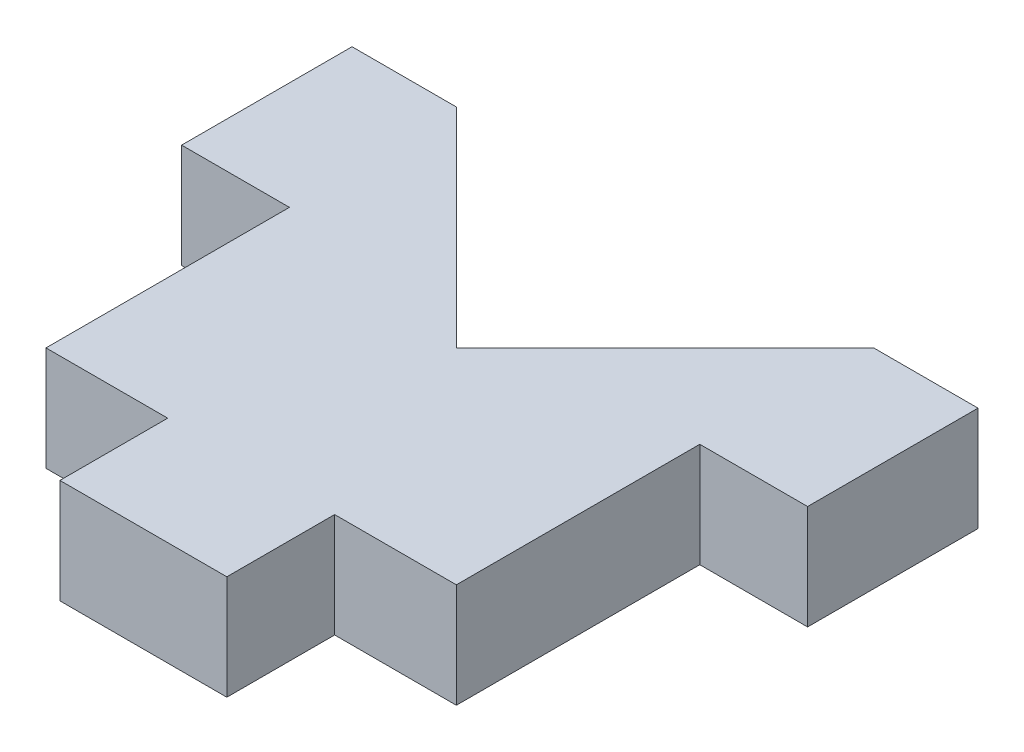
ISO-10303-21;
HEADER;
FILE_DESCRIPTION(('STEP AP214'),'2;1');
FILE_NAME('part.step','',(''),(''),'','','');
FILE_SCHEMA(('AUTOMOTIVE_DESIGN { 1 0 10303 214 1 1 1 1 }'));
ENDSEC;
DATA;
#1=APPLICATION_CONTEXT('core data for automotive mechanical design processes');
#2=APPLICATION_PROTOCOL_DEFINITION('international standard','automotive_design',2000,#1);
#3=PRODUCT_CONTEXT('',#1,'mechanical');
#4=PRODUCT('Part','Part','',(#3));
#5=PRODUCT_RELATED_PRODUCT_CATEGORY('part','',(#4));
#6=PRODUCT_DEFINITION_FORMATION('','',#4);
#7=PRODUCT_DEFINITION_CONTEXT('part definition',#1,'design');
#8=PRODUCT_DEFINITION('design','',#6,#7);
#9=PRODUCT_DEFINITION_SHAPE('','',#8);
#10=(LENGTH_UNIT() NAMED_UNIT(*) SI_UNIT(.MILLI.,.METRE.));
#11=(NAMED_UNIT(*) PLANE_ANGLE_UNIT() SI_UNIT($,.RADIAN.));
#12=(NAMED_UNIT(*) SI_UNIT($,.STERADIAN.) SOLID_ANGLE_UNIT());
#13=UNCERTAINTY_MEASURE_WITH_UNIT(LENGTH_MEASURE(1.E-05),#10,'distance_accuracy_value','');
#14=(GEOMETRIC_REPRESENTATION_CONTEXT(3) GLOBAL_UNCERTAINTY_ASSIGNED_CONTEXT((#13)) GLOBAL_UNIT_ASSIGNED_CONTEXT((#10,
#11,#12)) REPRESENTATION_CONTEXT('',''));
#15=CARTESIAN_POINT('',(0.,0.,0.));
#16=DIRECTION('',(0.,0.,1.));
#17=DIRECTION('',(1.,0.,0.));
#18=AXIS2_PLACEMENT_3D('',#15,#16,#17);
#19=CARTESIAN_POINT('',(8.99999999999995,2.99999999999998,0.));
#20=DIRECTION('',(0.,0.,-1.));
#21=DIRECTION('',(-1.,0.,0.));
#22=AXIS2_PLACEMENT_3D('',#19,#20,#21);
#23=PLANE('',#22);
#24=DIRECTION('',(0.,-1.,0.));
#25=VECTOR('',#24,1.);
#26=CARTESIAN_POINT('',(2.4,2.99999999999998,0.));
#27=LINE('',#26,#25);
#28=CARTESIAN_POINT('',(2.4,2.99999999999998,0.));
#29=VERTEX_POINT('',#28);
#30=CARTESIAN_POINT('',(2.4,0.,0.));
#31=VERTEX_POINT('',#30);
#32=EDGE_CURVE('E155',#29,#31,#27,.T.);
#33=ORIENTED_EDGE('',*,*,#32,.F.);
#34=DIRECTION('',(1.,0.,0.));
#35=VECTOR('',#34,1.);
#36=CARTESIAN_POINT('',(8.99999999999995,2.99999999999998,0.));
#37=LINE('',#36,#35);
#38=CARTESIAN_POINT('',(-2.4,2.99999999999998,0.));
#39=VERTEX_POINT('',#38);
#40=EDGE_CURVE('E213',#39,#29,#37,.T.);
#41=ORIENTED_EDGE('',*,*,#40,.F.);
#42=DIRECTION('',(0.,1.,0.));
#43=VECTOR('',#42,1.);
#44=CARTESIAN_POINT('',(-2.4,2.99999999999998,0.));
#45=LINE('',#44,#43);
#46=CARTESIAN_POINT('',(-2.4,0.,0.));
#47=VERTEX_POINT('',#46);
#48=EDGE_CURVE('E199',#47,#39,#45,.T.);
#49=ORIENTED_EDGE('',*,*,#48,.F.);
#50=DIRECTION('',(1.,0.,0.));
#51=VECTOR('',#50,1.);
#52=CARTESIAN_POINT('',(8.99999999999995,0.,0.));
#53=LINE('',#52,#51);
#54=EDGE_CURVE('E230',#47,#31,#53,.T.);
#55=ORIENTED_EDGE('',*,*,#54,.T.);
#56=EDGE_LOOP('',(#33,#41,#49,#55));
#57=FACE_BOUND('',#56,.T.);
#58=ADVANCED_FACE('F33',(#57),#23,.F.);
#59=CARTESIAN_POINT('',(0.,2.99999999999998,0.));
#60=DIRECTION('',(0.,1.,0.));
#61=DIRECTION('',(0.,0.,1.));
#62=AXIS2_PLACEMENT_3D('',#59,#60,#61);
#63=PLANE('',#62);
#64=DIRECTION('',(0.,0.,1.));
#65=VECTOR('',#64,1.);
#66=CARTESIAN_POINT('',(5.90000000000001,2.99999999999998,-10.1));
#67=LINE('',#66,#65);
#68=CARTESIAN_POINT('',(5.90000000000001,2.99999999999998,-10.1));
#69=VERTEX_POINT('',#68);
#70=CARTESIAN_POINT('',(5.90000000000001,2.99999999999998,-3.1));
#71=VERTEX_POINT('',#70);
#72=EDGE_CURVE('E147',#69,#71,#67,.T.);
#73=ORIENTED_EDGE('',*,*,#72,.F.);
#74=DIRECTION('',(-1.,0.,0.));
#75=VECTOR('',#74,1.);
#76=CARTESIAN_POINT('',(9.09999999999995,2.99999999999998,-10.1));
#77=LINE('',#76,#75);
#78=CARTESIAN_POINT('',(8.99999999999995,2.99999999999998,-10.1));
#79=VERTEX_POINT('',#78);
#80=EDGE_CURVE('E139',#79,#69,#77,.T.);
#81=ORIENTED_EDGE('',*,*,#80,.F.);
#82=DIRECTION('',(0.,0.,-1.));
#83=VECTOR('',#82,1.);
#84=CARTESIAN_POINT('',(8.99999999999995,2.99999999999998,-15.));
#85=LINE('',#84,#83);
#86=CARTESIAN_POINT('',(8.99999999999995,2.99999999999998,-15.));
#87=VERTEX_POINT('',#86);
#88=EDGE_CURVE('E216',#79,#87,#85,.T.);
#89=ORIENTED_EDGE('',*,*,#88,.T.);
#90=DIRECTION('',(-1.,0.,0.));
#91=VECTOR('',#90,1.);
#92=CARTESIAN_POINT('',(6.00000000000001,2.99999999999998,-15.));
#93=LINE('',#92,#91);
#94=CARTESIAN_POINT('',(6.00000000000001,2.99999999999998,-15.));
#95=VERTEX_POINT('',#94);
#96=EDGE_CURVE('E218',#87,#95,#93,.T.);
#97=ORIENTED_EDGE('',*,*,#96,.T.);
#98=DIRECTION('',(-0.707106781186548,0.,0.707106781186547));
#99=VECTOR('',#98,1.);
#100=CARTESIAN_POINT('',(6.00000000000001,2.99999999999998,-15.));
#101=LINE('',#100,#99);
#102=CARTESIAN_POINT('',(0.,2.99999999999998,-8.99999999999998));
#103=VERTEX_POINT('',#102);
#104=EDGE_CURVE('E220',#95,#103,#101,.T.);
#105=ORIENTED_EDGE('',*,*,#104,.T.);
#106=DIRECTION('',(-0.707106781186548,0.,-0.707106781186547));
#107=VECTOR('',#106,1.);
#108=CARTESIAN_POINT('',(0.,2.99999999999998,-8.99999999999998));
#109=LINE('',#108,#107);
#110=CARTESIAN_POINT('',(-6.00000000000002,2.99999999999998,-15.));
#111=VERTEX_POINT('',#110);
#112=EDGE_CURVE('E204',#103,#111,#109,.T.);
#113=ORIENTED_EDGE('',*,*,#112,.T.);
#114=DIRECTION('',(-1.,0.,0.));
#115=VECTOR('',#114,1.);
#116=CARTESIAN_POINT('',(-6.00000000000002,2.99999999999998,-15.));
#117=LINE('',#116,#115);
#118=CARTESIAN_POINT('',(-8.99999999999995,2.99999999999998,-15.));
#119=VERTEX_POINT('',#118);
#120=EDGE_CURVE('E207',#111,#119,#117,.T.);
#121=ORIENTED_EDGE('',*,*,#120,.T.);
#122=DIRECTION('',(0.,0.,1.));
#123=VECTOR('',#122,1.);
#124=CARTESIAN_POINT('',(-8.99999999999995,2.99999999999998,0.));
#125=LINE('',#124,#123);
#126=CARTESIAN_POINT('',(-8.99999999999995,2.99999999999998,-10.1));
#127=VERTEX_POINT('',#126);
#128=EDGE_CURVE('E210',#119,#127,#125,.T.);
#129=ORIENTED_EDGE('',*,*,#128,.T.);
#130=DIRECTION('',(-1.,0.,0.));
#131=VECTOR('',#130,1.);
#132=CARTESIAN_POINT('',(-5.90000000000001,2.99999999999998,-10.1));
#133=LINE('',#132,#131);
#134=CARTESIAN_POINT('',(-5.90000000000001,2.99999999999998,-10.1));
#135=VERTEX_POINT('',#134);
#136=EDGE_CURVE('E183',#135,#127,#133,.T.);
#137=ORIENTED_EDGE('',*,*,#136,.F.);
#138=DIRECTION('',(0.,0.,-1.));
#139=VECTOR('',#138,1.);
#140=CARTESIAN_POINT('',(-5.90000000000001,2.99999999999998,-3.1));
#141=LINE('',#140,#139);
#142=CARTESIAN_POINT('',(-5.90000000000001,2.99999999999998,-3.1));
#143=VERTEX_POINT('',#142);
#144=EDGE_CURVE('E180',#143,#135,#141,.T.);
#145=ORIENTED_EDGE('',*,*,#144,.F.);
#146=DIRECTION('',(-1.,0.,0.));
#147=VECTOR('',#146,1.);
#148=CARTESIAN_POINT('',(-2.4,2.99999999999998,-3.1));
#149=LINE('',#148,#147);
#150=CARTESIAN_POINT('',(-2.4,2.99999999999998,-3.1));
#151=VERTEX_POINT('',#150);
#152=EDGE_CURVE('E178',#151,#143,#149,.T.);
#153=ORIENTED_EDGE('',*,*,#152,.F.);
#154=DIRECTION('',(0.,0.,-1.));
#155=VECTOR('',#154,1.);
#156=CARTESIAN_POINT('',(-2.4,2.99999999999998,0.100000000000002));
#157=LINE('',#156,#155);
#158=EDGE_CURVE('E185',#39,#151,#157,.T.);
#159=ORIENTED_EDGE('',*,*,#158,.F.);
#160=ORIENTED_EDGE('',*,*,#40,.T.);
#161=DIRECTION('',(0.,0.,1.));
#162=VECTOR('',#161,1.);
#163=CARTESIAN_POINT('',(2.4,2.99999999999998,-3.1));
#164=LINE('',#163,#162);
#165=CARTESIAN_POINT('',(2.4,2.99999999999998,-3.1));
#166=VERTEX_POINT('',#165);
#167=EDGE_CURVE('E163',#166,#29,#164,.T.);
#168=ORIENTED_EDGE('',*,*,#167,.F.);
#169=DIRECTION('',(-1.,0.,0.));
#170=VECTOR('',#169,1.);
#171=CARTESIAN_POINT('',(5.90000000000001,2.99999999999998,-3.1));
#172=LINE('',#171,#170);
#173=EDGE_CURVE('E161',#71,#166,#172,.T.);
#174=ORIENTED_EDGE('',*,*,#173,.F.);
#175=EDGE_LOOP('',(#73,#81,#89,#97,#105,#113,#121,#129,#137,#145,#153,#159,#160,#168,#174));
#176=FACE_BOUND('',#175,.T.);
#177=ADVANCED_FACE('F159',(#176),#63,.T.);
#178=CARTESIAN_POINT('',(0.,0.,0.));
#179=DIRECTION('',(0.,1.,0.));
#180=DIRECTION('',(0.,0.,1.));
#181=AXIS2_PLACEMENT_3D('',#178,#179,#180);
#182=PLANE('',#181);
#183=DIRECTION('',(-1.,0.,0.));
#184=VECTOR('',#183,1.);
#185=CARTESIAN_POINT('',(9.09999999999995,0.,-10.1));
#186=LINE('',#185,#184);
#187=CARTESIAN_POINT('',(8.99999999999995,0.,-10.1));
#188=VERTEX_POINT('',#187);
#189=CARTESIAN_POINT('',(5.90000000000001,0.,-10.1));
#190=VERTEX_POINT('',#189);
#191=EDGE_CURVE('E47',#188,#190,#186,.T.);
#192=ORIENTED_EDGE('',*,*,#191,.T.);
#193=DIRECTION('',(0.,0.,1.));
#194=VECTOR('',#193,1.);
#195=CARTESIAN_POINT('',(5.90000000000001,0.,-10.1));
#196=LINE('',#195,#194);
#197=CARTESIAN_POINT('',(5.90000000000001,0.,-3.1));
#198=VERTEX_POINT('',#197);
#199=EDGE_CURVE('E154',#190,#198,#196,.T.);
#200=ORIENTED_EDGE('',*,*,#199,.T.);
#201=DIRECTION('',(-1.,0.,0.));
#202=VECTOR('',#201,1.);
#203=CARTESIAN_POINT('',(5.90000000000001,0.,-3.1));
#204=LINE('',#203,#202);
#205=CARTESIAN_POINT('',(2.4,0.,-3.1));
#206=VERTEX_POINT('',#205);
#207=EDGE_CURVE('E170',#198,#206,#204,.T.);
#208=ORIENTED_EDGE('',*,*,#207,.T.);
#209=DIRECTION('',(0.,0.,1.));
#210=VECTOR('',#209,1.);
#211=CARTESIAN_POINT('',(2.4,0.,-3.1));
#212=LINE('',#211,#210);
#213=EDGE_CURVE('E148',#206,#31,#212,.T.);
#214=ORIENTED_EDGE('',*,*,#213,.T.);
#215=ORIENTED_EDGE('',*,*,#54,.F.);
#216=DIRECTION('',(0.,0.,1.));
#217=VECTOR('',#216,1.);
#218=CARTESIAN_POINT('',(-2.4,0.,0.));
#219=LINE('',#218,#217);
#220=CARTESIAN_POINT('',(-2.4,0.,-3.1));
#221=VERTEX_POINT('',#220);
#222=EDGE_CURVE('E41',#221,#47,#219,.T.);
#223=ORIENTED_EDGE('',*,*,#222,.F.);
#224=DIRECTION('',(-1.,0.,0.));
#225=VECTOR('',#224,1.);
#226=CARTESIAN_POINT('',(-2.4,0.,-3.1));
#227=LINE('',#226,#225);
#228=CARTESIAN_POINT('',(-5.90000000000001,0.,-3.1));
#229=VERTEX_POINT('',#228);
#230=EDGE_CURVE('E55',#221,#229,#227,.T.);
#231=ORIENTED_EDGE('',*,*,#230,.T.);
#232=DIRECTION('',(0.,0.,-1.));
#233=VECTOR('',#232,1.);
#234=CARTESIAN_POINT('',(-5.90000000000001,0.,-3.1));
#235=LINE('',#234,#233);
#236=CARTESIAN_POINT('',(-5.90000000000001,0.,-10.1));
#237=VERTEX_POINT('',#236);
#238=EDGE_CURVE('E189',#229,#237,#235,.T.);
#239=ORIENTED_EDGE('',*,*,#238,.T.);
#240=DIRECTION('',(-1.,0.,0.));
#241=VECTOR('',#240,1.);
#242=CARTESIAN_POINT('',(-5.90000000000001,0.,-10.1));
#243=LINE('',#242,#241);
#244=CARTESIAN_POINT('',(-8.99999999999995,0.,-10.1));
#245=VERTEX_POINT('',#244);
#246=EDGE_CURVE('E181',#237,#245,#243,.T.);
#247=ORIENTED_EDGE('',*,*,#246,.T.);
#248=DIRECTION('',(0.,0.,1.));
#249=VECTOR('',#248,1.);
#250=CARTESIAN_POINT('',(-8.99999999999995,0.,0.));
#251=LINE('',#250,#249);
#252=CARTESIAN_POINT('',(-8.99999999999995,0.,-15.));
#253=VERTEX_POINT('',#252);
#254=EDGE_CURVE('E227',#253,#245,#251,.T.);
#255=ORIENTED_EDGE('',*,*,#254,.F.);
#256=DIRECTION('',(-1.,0.,0.));
#257=VECTOR('',#256,1.);
#258=CARTESIAN_POINT('',(-6.00000000000002,0.,-15.));
#259=LINE('',#258,#257);
#260=CARTESIAN_POINT('',(-6.00000000000002,0.,-15.));
#261=VERTEX_POINT('',#260);
#262=EDGE_CURVE('E225',#261,#253,#259,.T.);
#263=ORIENTED_EDGE('',*,*,#262,.F.);
#264=DIRECTION('',(-0.707106781186548,0.,-0.707106781186547));
#265=VECTOR('',#264,1.);
#266=CARTESIAN_POINT('',(0.,0.,-8.99999999999998));
#267=LINE('',#266,#265);
#268=CARTESIAN_POINT('',(0.,0.,-8.99999999999998));
#269=VERTEX_POINT('',#268);
#270=EDGE_CURVE('E203',#269,#261,#267,.T.);
#271=ORIENTED_EDGE('',*,*,#270,.F.);
#272=DIRECTION('',(-0.707106781186548,0.,0.707106781186547));
#273=VECTOR('',#272,1.);
#274=CARTESIAN_POINT('',(6.00000000000001,0.,-15.));
#275=LINE('',#274,#273);
#276=CARTESIAN_POINT('',(6.00000000000001,0.,-15.));
#277=VERTEX_POINT('',#276);
#278=EDGE_CURVE('E208',#277,#269,#275,.T.);
#279=ORIENTED_EDGE('',*,*,#278,.F.);
#280=DIRECTION('',(-1.,0.,0.));
#281=VECTOR('',#280,1.);
#282=CARTESIAN_POINT('',(6.00000000000001,0.,-15.));
#283=LINE('',#282,#281);
#284=CARTESIAN_POINT('',(8.99999999999995,0.,-15.));
#285=VERTEX_POINT('',#284);
#286=EDGE_CURVE('E235',#285,#277,#283,.T.);
#287=ORIENTED_EDGE('',*,*,#286,.F.);
#288=DIRECTION('',(0.,0.,-1.));
#289=VECTOR('',#288,1.);
#290=CARTESIAN_POINT('',(8.99999999999995,0.,-15.));
#291=LINE('',#290,#289);
#292=EDGE_CURVE('E233',#188,#285,#291,.T.);
#293=ORIENTED_EDGE('',*,*,#292,.F.);
#294=EDGE_LOOP('',(#192,#200,#208,#214,#215,#223,#231,#239,#247,#255,#263,#271,#279,#287,#293));
#295=FACE_BOUND('',#294,.T.);
#296=ADVANCED_FACE('F261',(#295),#182,.F.);
#297=CARTESIAN_POINT('',(8.99999999999995,2.99999999999998,-15.));
#298=DIRECTION('',(-1.,0.,0.));
#299=DIRECTION('',(0.,0.,1.));
#300=AXIS2_PLACEMENT_3D('',#297,#298,#299);
#301=PLANE('',#300);
#302=DIRECTION('',(0.,1.,0.));
#303=VECTOR('',#302,1.);
#304=CARTESIAN_POINT('',(8.99999999999995,2.99999999999998,-10.1));
#305=LINE('',#304,#303);
#306=EDGE_CURVE('E11',#188,#79,#305,.T.);
#307=ORIENTED_EDGE('',*,*,#306,.F.);
#308=ORIENTED_EDGE('',*,*,#292,.T.);
#309=DIRECTION('',(0.,-1.,0.));
#310=VECTOR('',#309,1.);
#311=CARTESIAN_POINT('',(8.99999999999995,2.99999999999998,-15.));
#312=LINE('',#311,#310);
#313=EDGE_CURVE('E243',#87,#285,#312,.T.);
#314=ORIENTED_EDGE('',*,*,#313,.F.);
#315=ORIENTED_EDGE('',*,*,#88,.F.);
#316=EDGE_LOOP('',(#307,#308,#314,#315));
#317=FACE_BOUND('',#316,.T.);
#318=ADVANCED_FACE('F303',(#317),#301,.F.);
#319=CARTESIAN_POINT('',(-8.99999999999995,2.99999999999998,0.));
#320=DIRECTION('',(1.,0.,0.));
#321=DIRECTION('',(0.,0.,-1.));
#322=AXIS2_PLACEMENT_3D('',#319,#320,#321);
#323=PLANE('',#322);
#324=DIRECTION('',(0.,-1.,0.));
#325=VECTOR('',#324,1.);
#326=CARTESIAN_POINT('',(-8.99999999999995,2.99999999999998,-10.1));
#327=LINE('',#326,#325);
#328=EDGE_CURVE('E201',#127,#245,#327,.T.);
#329=ORIENTED_EDGE('',*,*,#328,.F.);
#330=ORIENTED_EDGE('',*,*,#128,.F.);
#331=DIRECTION('',(0.,-1.,0.));
#332=VECTOR('',#331,1.);
#333=CARTESIAN_POINT('',(-8.99999999999995,2.99999999999998,-15.));
#334=LINE('',#333,#332);
#335=EDGE_CURVE('E246',#119,#253,#334,.T.);
#336=ORIENTED_EDGE('',*,*,#335,.T.);
#337=ORIENTED_EDGE('',*,*,#254,.T.);
#338=EDGE_LOOP('',(#329,#330,#336,#337));
#339=FACE_BOUND('',#338,.T.);
#340=ADVANCED_FACE('F281',(#339),#323,.F.);
#341=CARTESIAN_POINT('',(0.,2.99999999999998,-8.99999999999998));
#342=DIRECTION('',(-0.707106781186547,0.,0.707106781186548));
#343=DIRECTION('',(0.707106781186548,0.,0.707106781186547));
#344=AXIS2_PLACEMENT_3D('',#341,#342,#343);
#345=PLANE('',#344);
#346=ORIENTED_EDGE('',*,*,#270,.T.);
#347=DIRECTION('',(0.,-1.,0.));
#348=VECTOR('',#347,1.);
#349=CARTESIAN_POINT('',(-6.00000000000002,2.99999999999998,-15.));
#350=LINE('',#349,#348);
#351=EDGE_CURVE('E249',#111,#261,#350,.T.);
#352=ORIENTED_EDGE('',*,*,#351,.F.);
#353=ORIENTED_EDGE('',*,*,#112,.F.);
#354=DIRECTION('',(0.,-1.,0.));
#355=VECTOR('',#354,1.);
#356=CARTESIAN_POINT('',(0.,2.99999999999998,-8.99999999999998));
#357=LINE('',#356,#355);
#358=EDGE_CURVE('E222',#103,#269,#357,.T.);
#359=ORIENTED_EDGE('',*,*,#358,.T.);
#360=EDGE_LOOP('',(#346,#352,#353,#359));
#361=FACE_BOUND('',#360,.T.);
#362=ADVANCED_FACE('F35',(#361),#345,.F.);
#363=CARTESIAN_POINT('',(-6.00000000000002,2.99999999999998,-15.));
#364=DIRECTION('',(0.,0.,1.));
#365=DIRECTION('',(1.,0.,0.));
#366=AXIS2_PLACEMENT_3D('',#363,#364,#365);
#367=PLANE('',#366);
#368=ORIENTED_EDGE('',*,*,#262,.T.);
#369=ORIENTED_EDGE('',*,*,#335,.F.);
#370=ORIENTED_EDGE('',*,*,#120,.F.);
#371=ORIENTED_EDGE('',*,*,#351,.T.);
#372=EDGE_LOOP('',(#368,#369,#370,#371));
#373=FACE_BOUND('',#372,.T.);
#374=ADVANCED_FACE('F288',(#373),#367,.F.);
#375=CARTESIAN_POINT('',(6.00000000000001,2.99999999999998,-15.));
#376=DIRECTION('',(0.,0.,1.));
#377=DIRECTION('',(1.,0.,0.));
#378=AXIS2_PLACEMENT_3D('',#375,#376,#377);
#379=PLANE('',#378);
#380=ORIENTED_EDGE('',*,*,#286,.T.);
#381=DIRECTION('',(0.,-1.,0.));
#382=VECTOR('',#381,1.);
#383=CARTESIAN_POINT('',(6.00000000000001,2.99999999999998,-15.));
#384=LINE('',#383,#382);
#385=EDGE_CURVE('E240',#95,#277,#384,.T.);
#386=ORIENTED_EDGE('',*,*,#385,.F.);
#387=ORIENTED_EDGE('',*,*,#96,.F.);
#388=ORIENTED_EDGE('',*,*,#313,.T.);
#389=EDGE_LOOP('',(#380,#386,#387,#388));
#390=FACE_BOUND('',#389,.T.);
#391=ADVANCED_FACE('F299',(#390),#379,.F.);
#392=CARTESIAN_POINT('',(6.00000000000001,2.99999999999998,-15.));
#393=DIRECTION('',(0.707106781186547,0.,0.707106781186548));
#394=DIRECTION('',(0.707106781186548,0.,-0.707106781186547));
#395=AXIS2_PLACEMENT_3D('',#392,#393,#394);
#396=PLANE('',#395);
#397=ORIENTED_EDGE('',*,*,#278,.T.);
#398=ORIENTED_EDGE('',*,*,#358,.F.);
#399=ORIENTED_EDGE('',*,*,#104,.F.);
#400=ORIENTED_EDGE('',*,*,#385,.T.);
#401=EDGE_LOOP('',(#397,#398,#399,#400));
#402=FACE_BOUND('',#401,.T.);
#403=ADVANCED_FACE('F294',(#402),#396,.F.);
#404=CARTESIAN_POINT('',(-5.90000000000001,2.99999999999998,-10.1));
#405=DIRECTION('',(0.,0.,1.));
#406=DIRECTION('',(1.,0.,0.));
#407=AXIS2_PLACEMENT_3D('',#404,#405,#406);
#408=PLANE('',#407);
#409=ORIENTED_EDGE('',*,*,#328,.T.);
#410=ORIENTED_EDGE('',*,*,#246,.F.);
#411=DIRECTION('',(0.,-1.,0.));
#412=VECTOR('',#411,1.);
#413=CARTESIAN_POINT('',(-5.90000000000001,2.99999999999998,-10.1));
#414=LINE('',#413,#412);
#415=EDGE_CURVE('E195',#135,#237,#414,.T.);
#416=ORIENTED_EDGE('',*,*,#415,.F.);
#417=ORIENTED_EDGE('',*,*,#136,.T.);
#418=EDGE_LOOP('',(#409,#410,#416,#417));
#419=FACE_BOUND('',#418,.T.);
#420=ADVANCED_FACE('F278',(#419),#408,.T.);
#421=CARTESIAN_POINT('',(-2.4,2.99999999999998,0.100000000000002));
#422=DIRECTION('',(-1.,0.,0.));
#423=DIRECTION('',(0.,0.,1.));
#424=AXIS2_PLACEMENT_3D('',#421,#422,#423);
#425=PLANE('',#424);
#426=ORIENTED_EDGE('',*,*,#48,.T.);
#427=ORIENTED_EDGE('',*,*,#158,.T.);
#428=DIRECTION('',(0.,-1.,0.));
#429=VECTOR('',#428,1.);
#430=CARTESIAN_POINT('',(-2.4,2.99999999999998,-3.1));
#431=LINE('',#430,#429);
#432=EDGE_CURVE('E187',#151,#221,#431,.T.);
#433=ORIENTED_EDGE('',*,*,#432,.T.);
#434=ORIENTED_EDGE('',*,*,#222,.T.);
#435=EDGE_LOOP('',(#426,#427,#433,#434));
#436=FACE_BOUND('',#435,.T.);
#437=ADVANCED_FACE('F254',(#436),#425,.T.);
#438=CARTESIAN_POINT('',(-2.4,2.99999999999998,-3.1));
#439=DIRECTION('',(0.,0.,1.));
#440=DIRECTION('',(1.,0.,0.));
#441=AXIS2_PLACEMENT_3D('',#438,#439,#440);
#442=PLANE('',#441);
#443=ORIENTED_EDGE('',*,*,#230,.F.);
#444=ORIENTED_EDGE('',*,*,#432,.F.);
#445=ORIENTED_EDGE('',*,*,#152,.T.);
#446=DIRECTION('',(0.,-1.,0.));
#447=VECTOR('',#446,1.);
#448=CARTESIAN_POINT('',(-5.90000000000001,2.99999999999998,-3.1));
#449=LINE('',#448,#447);
#450=EDGE_CURVE('E197',#143,#229,#449,.T.);
#451=ORIENTED_EDGE('',*,*,#450,.T.);
#452=EDGE_LOOP('',(#443,#444,#445,#451));
#453=FACE_BOUND('',#452,.T.);
#454=ADVANCED_FACE('F269',(#453),#442,.T.);
#455=CARTESIAN_POINT('',(-5.90000000000001,2.99999999999998,-3.1));
#456=DIRECTION('',(-1.,0.,0.));
#457=DIRECTION('',(0.,0.,1.));
#458=AXIS2_PLACEMENT_3D('',#455,#456,#457);
#459=PLANE('',#458);
#460=ORIENTED_EDGE('',*,*,#238,.F.);
#461=ORIENTED_EDGE('',*,*,#450,.F.);
#462=ORIENTED_EDGE('',*,*,#144,.T.);
#463=ORIENTED_EDGE('',*,*,#415,.T.);
#464=EDGE_LOOP('',(#460,#461,#462,#463));
#465=FACE_BOUND('',#464,.T.);
#466=ADVANCED_FACE('F272',(#465),#459,.T.);
#467=CARTESIAN_POINT('',(2.4,2.99999999999998,-3.1));
#468=DIRECTION('',(1.,0.,0.));
#469=DIRECTION('',(0.,0.,-1.));
#470=AXIS2_PLACEMENT_3D('',#467,#468,#469);
#471=PLANE('',#470);
#472=ORIENTED_EDGE('',*,*,#32,.T.);
#473=ORIENTED_EDGE('',*,*,#213,.F.);
#474=DIRECTION('',(0.,-1.,0.));
#475=VECTOR('',#474,1.);
#476=CARTESIAN_POINT('',(2.4,2.99999999999998,-3.1));
#477=LINE('',#476,#475);
#478=EDGE_CURVE('E167',#166,#206,#477,.T.);
#479=ORIENTED_EDGE('',*,*,#478,.F.);
#480=ORIENTED_EDGE('',*,*,#167,.T.);
#481=EDGE_LOOP('',(#472,#473,#479,#480));
#482=FACE_BOUND('',#481,.T.);
#483=ADVANCED_FACE('F266',(#482),#471,.T.);
#484=CARTESIAN_POINT('',(9.09999999999995,2.99999999999998,-10.1));
#485=DIRECTION('',(0.,0.,1.));
#486=DIRECTION('',(1.,0.,0.));
#487=AXIS2_PLACEMENT_3D('',#484,#485,#486);
#488=PLANE('',#487);
#489=ORIENTED_EDGE('',*,*,#306,.T.);
#490=ORIENTED_EDGE('',*,*,#80,.T.);
#491=DIRECTION('',(0.,-1.,0.));
#492=VECTOR('',#491,1.);
#493=CARTESIAN_POINT('',(5.90000000000001,2.99999999999998,-10.1));
#494=LINE('',#493,#492);
#495=EDGE_CURVE('E142',#69,#190,#494,.T.);
#496=ORIENTED_EDGE('',*,*,#495,.T.);
#497=ORIENTED_EDGE('',*,*,#191,.F.);
#498=EDGE_LOOP('',(#489,#490,#496,#497));
#499=FACE_BOUND('',#498,.T.);
#500=ADVANCED_FACE('F141',(#499),#488,.T.);
#501=CARTESIAN_POINT('',(5.90000000000001,2.99999999999998,-10.1));
#502=DIRECTION('',(1.,0.,0.));
#503=DIRECTION('',(0.,0.,-1.));
#504=AXIS2_PLACEMENT_3D('',#501,#502,#503);
#505=PLANE('',#504);
#506=ORIENTED_EDGE('',*,*,#199,.F.);
#507=ORIENTED_EDGE('',*,*,#495,.F.);
#508=ORIENTED_EDGE('',*,*,#72,.T.);
#509=DIRECTION('',(0.,-1.,0.));
#510=VECTOR('',#509,1.);
#511=CARTESIAN_POINT('',(5.90000000000001,2.99999999999998,-3.1));
#512=LINE('',#511,#510);
#513=EDGE_CURVE('E156',#71,#198,#512,.T.);
#514=ORIENTED_EDGE('',*,*,#513,.T.);
#515=EDGE_LOOP('',(#506,#507,#508,#514));
#516=FACE_BOUND('',#515,.T.);
#517=ADVANCED_FACE('F151',(#516),#505,.T.);
#518=CARTESIAN_POINT('',(5.90000000000001,2.99999999999998,-3.1));
#519=DIRECTION('',(0.,0.,1.));
#520=DIRECTION('',(1.,0.,0.));
#521=AXIS2_PLACEMENT_3D('',#518,#519,#520);
#522=PLANE('',#521);
#523=ORIENTED_EDGE('',*,*,#207,.F.);
#524=ORIENTED_EDGE('',*,*,#513,.F.);
#525=ORIENTED_EDGE('',*,*,#173,.T.);
#526=ORIENTED_EDGE('',*,*,#478,.T.);
#527=EDGE_LOOP('',(#523,#524,#525,#526));
#528=FACE_BOUND('',#527,.T.);
#529=ADVANCED_FACE('F393',(#528),#522,.T.);
#530=CLOSED_SHELL('',(#58,#177,#296,#318,#340,#362,#374,#391,#403,#420,#437,#454,#466,#483,#500,
#517,#529));
#531=MANIFOLD_SOLID_BREP('B2',#530);
#532=ADVANCED_BREP_SHAPE_REPRESENTATION('',(#18,#531),#14);
#533=SHAPE_DEFINITION_REPRESENTATION(#9,#532);
ENDSEC;
END-ISO-10303-21;
